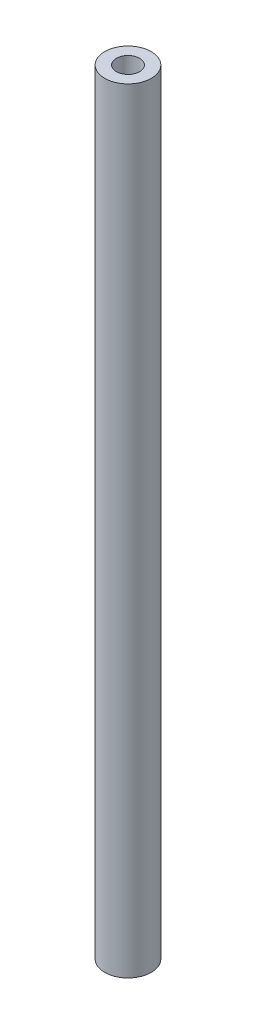
ISO-10303-21;
HEADER;
FILE_DESCRIPTION(('STEP AP214'),'2;1');
FILE_NAME('part.step','',(''),(''),'','','');
FILE_SCHEMA(('AUTOMOTIVE_DESIGN { 1 0 10303 214 1 1 1 1 }'));
ENDSEC;
DATA;
#1=APPLICATION_CONTEXT('core data for automotive mechanical design processes');
#2=APPLICATION_PROTOCOL_DEFINITION('international standard','automotive_design',2000,#1);
#3=PRODUCT_CONTEXT('',#1,'mechanical');
#4=PRODUCT('Part','Part','',(#3));
#5=PRODUCT_RELATED_PRODUCT_CATEGORY('part','',(#4));
#6=PRODUCT_DEFINITION_FORMATION('','',#4);
#7=PRODUCT_DEFINITION_CONTEXT('part definition',#1,'design');
#8=PRODUCT_DEFINITION('design','',#6,#7);
#9=PRODUCT_DEFINITION_SHAPE('','',#8);
#10=(LENGTH_UNIT() NAMED_UNIT(*) SI_UNIT(.MILLI.,.METRE.));
#11=(NAMED_UNIT(*) PLANE_ANGLE_UNIT() SI_UNIT($,.RADIAN.));
#12=(NAMED_UNIT(*) SI_UNIT($,.STERADIAN.) SOLID_ANGLE_UNIT());
#13=UNCERTAINTY_MEASURE_WITH_UNIT(LENGTH_MEASURE(1.E-05),#10,'distance_accuracy_value','');
#14=(GEOMETRIC_REPRESENTATION_CONTEXT(3) GLOBAL_UNCERTAINTY_ASSIGNED_CONTEXT((#13)) GLOBAL_UNIT_ASSIGNED_CONTEXT((#10,
#11,#12)) REPRESENTATION_CONTEXT('',''));
#15=CARTESIAN_POINT('',(0.,0.,0.));
#16=DIRECTION('',(0.,0.,1.));
#17=DIRECTION('',(1.,0.,0.));
#18=AXIS2_PLACEMENT_3D('',#15,#16,#17);
#19=CARTESIAN_POINT('',(0.,100.,0.));
#20=DIRECTION('',(0.,1.,0.));
#21=DIRECTION('',(0.,0.,1.));
#22=AXIS2_PLACEMENT_3D('',#19,#20,#21);
#23=PLANE('',#22);
#24=CARTESIAN_POINT('',(0.,100.,0.));
#25=DIRECTION('',(0.,1.,0.));
#26=DIRECTION('',(0.,0.,1.));
#27=AXIS2_PLACEMENT_3D('',#24,#25,#26);
#28=CIRCLE('',#27,3.);
#29=CARTESIAN_POINT('',(0.,100.,3.));
#30=VERTEX_POINT('',#29);
#31=EDGE_CURVE('E10',#30,#30,#28,.T.);
#32=ORIENTED_EDGE('',*,*,#31,.T.);
#33=EDGE_LOOP('',(#32));
#34=FACE_BOUND('',#33,.T.);
#35=CARTESIAN_POINT('',(0.,100.,0.));
#36=DIRECTION('',(0.,1.,0.));
#37=DIRECTION('',(0.,0.,1.));
#38=AXIS2_PLACEMENT_3D('',#35,#36,#37);
#39=CIRCLE('',#38,1.5);
#40=CARTESIAN_POINT('',(0.,100.,1.5));
#41=VERTEX_POINT('',#40);
#42=EDGE_CURVE('E44',#41,#41,#39,.T.);
#43=ORIENTED_EDGE('',*,*,#42,.F.);
#44=EDGE_LOOP('',(#43));
#45=FACE_BOUND('',#44,.T.);
#46=ADVANCED_FACE('F33',(#34,#45),#23,.T.);
#47=CARTESIAN_POINT('',(0.,0.,0.));
#48=DIRECTION('',(0.,1.,0.));
#49=DIRECTION('',(0.,0.,1.));
#50=AXIS2_PLACEMENT_3D('',#47,#48,#49);
#51=PLANE('',#50);
#52=CARTESIAN_POINT('',(0.,0.,0.));
#53=DIRECTION('',(0.,1.,0.));
#54=DIRECTION('',(0.,0.,1.));
#55=AXIS2_PLACEMENT_3D('',#52,#53,#54);
#56=CIRCLE('',#55,3.);
#57=CARTESIAN_POINT('',(0.,0.,3.));
#58=VERTEX_POINT('',#57);
#59=EDGE_CURVE('E37',#58,#58,#56,.T.);
#60=ORIENTED_EDGE('',*,*,#59,.F.);
#61=EDGE_LOOP('',(#60));
#62=FACE_BOUND('',#61,.T.);
#63=CARTESIAN_POINT('',(0.,0.,0.));
#64=DIRECTION('',(0.,1.,0.));
#65=DIRECTION('',(0.,0.,1.));
#66=AXIS2_PLACEMENT_3D('',#63,#64,#65);
#67=CIRCLE('',#66,1.5);
#68=CARTESIAN_POINT('',(0.,0.,1.5));
#69=VERTEX_POINT('',#68);
#70=EDGE_CURVE('E46',#69,#69,#67,.T.);
#71=ORIENTED_EDGE('',*,*,#70,.T.);
#72=EDGE_LOOP('',(#71));
#73=FACE_BOUND('',#72,.T.);
#74=ADVANCED_FACE('F56',(#62,#73),#51,.F.);
#75=CARTESIAN_POINT('',(0.,100.,0.));
#76=DIRECTION('',(0.,-1.,0.));
#77=DIRECTION('',(0.,0.,-1.));
#78=AXIS2_PLACEMENT_3D('',#75,#76,#77);
#79=CYLINDRICAL_SURFACE('',#78,3.);
#80=ORIENTED_EDGE('',*,*,#31,.F.);
#81=EDGE_LOOP('',(#80));
#82=FACE_BOUND('',#81,.T.);
#83=ORIENTED_EDGE('',*,*,#59,.T.);
#84=EDGE_LOOP('',(#83));
#85=FACE_BOUND('',#84,.T.);
#86=ADVANCED_FACE('F35',(#82,#85),#79,.T.);
#87=CARTESIAN_POINT('',(0.,100.,0.));
#88=DIRECTION('',(0.,-1.,0.));
#89=DIRECTION('',(0.,0.,-1.));
#90=AXIS2_PLACEMENT_3D('',#87,#88,#89);
#91=CYLINDRICAL_SURFACE('',#90,1.5);
#92=ORIENTED_EDGE('',*,*,#42,.T.);
#93=EDGE_LOOP('',(#92));
#94=FACE_BOUND('',#93,.T.);
#95=ORIENTED_EDGE('',*,*,#70,.F.);
#96=EDGE_LOOP('',(#95));
#97=FACE_BOUND('',#96,.T.);
#98=ADVANCED_FACE('F52',(#94,#97),#91,.F.);
#99=CLOSED_SHELL('',(#46,#74,#86,#98));
#100=MANIFOLD_SOLID_BREP('B2',#99);
#101=ADVANCED_BREP_SHAPE_REPRESENTATION('',(#18,#100),#14);
#102=SHAPE_DEFINITION_REPRESENTATION(#9,#101);
ENDSEC;
END-ISO-10303-21;
